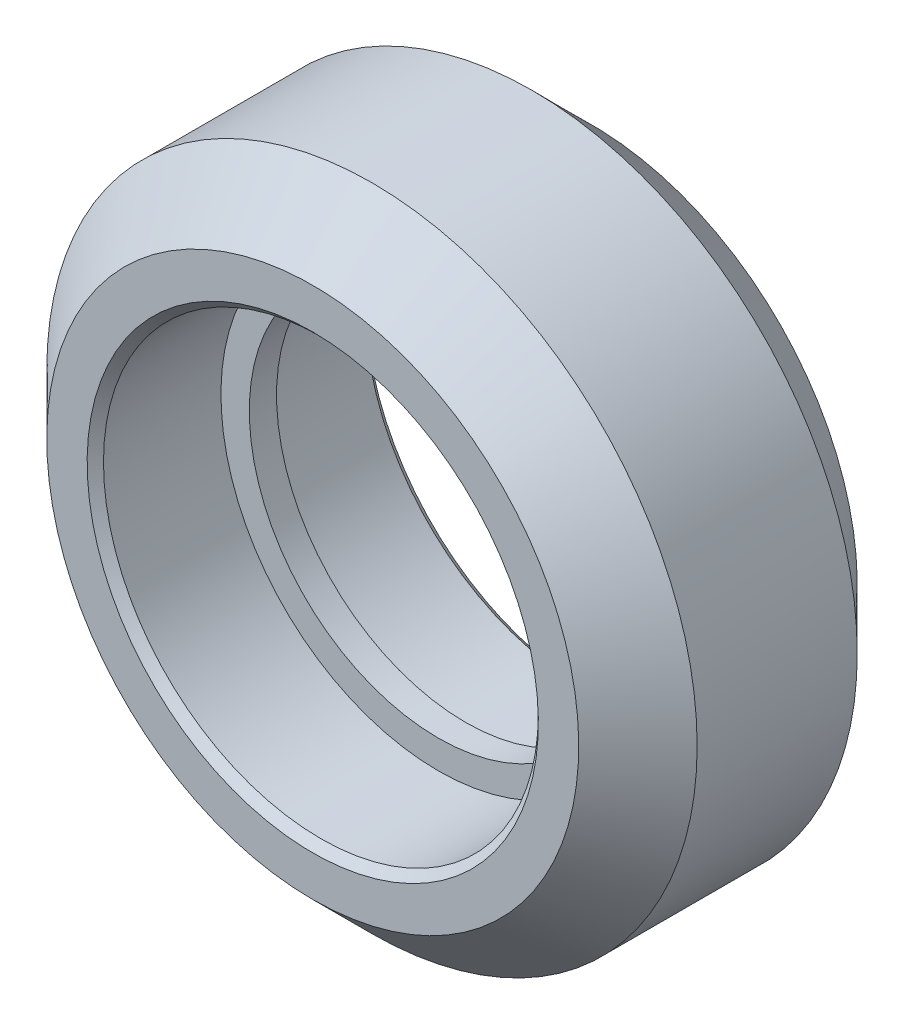
ISO-10303-21;
HEADER;
FILE_DESCRIPTION(('STEP AP214'),'2;1');
FILE_NAME('part.step','',(''),(''),'','','');
FILE_SCHEMA(('AUTOMOTIVE_DESIGN { 1 0 10303 214 1 1 1 1 }'));
ENDSEC;
DATA;
#1=APPLICATION_CONTEXT('core data for automotive mechanical design processes');
#2=APPLICATION_PROTOCOL_DEFINITION('international standard','automotive_design',2000,#1);
#3=PRODUCT_CONTEXT('',#1,'mechanical');
#4=PRODUCT('Part','Part','',(#3));
#5=PRODUCT_RELATED_PRODUCT_CATEGORY('part','',(#4));
#6=PRODUCT_DEFINITION_FORMATION('','',#4);
#7=PRODUCT_DEFINITION_CONTEXT('part definition',#1,'design');
#8=PRODUCT_DEFINITION('design','',#6,#7);
#9=PRODUCT_DEFINITION_SHAPE('','',#8);
#10=(LENGTH_UNIT() NAMED_UNIT(*) SI_UNIT(.MILLI.,.METRE.));
#11=(NAMED_UNIT(*) PLANE_ANGLE_UNIT() SI_UNIT($,.RADIAN.));
#12=(NAMED_UNIT(*) SI_UNIT($,.STERADIAN.) SOLID_ANGLE_UNIT());
#13=UNCERTAINTY_MEASURE_WITH_UNIT(LENGTH_MEASURE(1.E-05),#10,'distance_accuracy_value','');
#14=(GEOMETRIC_REPRESENTATION_CONTEXT(3) GLOBAL_UNCERTAINTY_ASSIGNED_CONTEXT((#13)) GLOBAL_UNIT_ASSIGNED_CONTEXT((#10,
#11,#12)) REPRESENTATION_CONTEXT('',''));
#15=CARTESIAN_POINT('',(0.,0.,0.));
#16=DIRECTION('',(0.,0.,1.));
#17=DIRECTION('',(1.,0.,0.));
#18=AXIS2_PLACEMENT_3D('',#15,#16,#17);
#19=CARTESIAN_POINT('',(0.,0.,5.115));
#20=DIRECTION('',(0.,0.,1.));
#21=DIRECTION('',(0.,-1.,0.));
#22=AXIS2_PLACEMENT_3D('',#19,#20,#21);
#23=CYLINDRICAL_SURFACE('',#22,7.987);
#24=CARTESIAN_POINT('',(0.,0.,4.815));
#25=DIRECTION('',(0.,0.,-1.));
#26=DIRECTION('',(0.,1.,0.));
#27=AXIS2_PLACEMENT_3D('',#24,#25,#26);
#28=CIRCLE('',#27,7.987);
#29=CARTESIAN_POINT('',(0.,7.987,4.815));
#30=VERTEX_POINT('',#29);
#31=EDGE_CURVE('E46',#30,#30,#28,.F.);
#32=ORIENTED_EDGE('',*,*,#31,.T.);
#33=EDGE_LOOP('',(#32));
#34=FACE_BOUND('',#33,.T.);
#35=CARTESIAN_POINT('',(0.,0.,0.499999999999998));
#36=DIRECTION('',(0.,0.,1.));
#37=DIRECTION('',(0.,-1.,0.));
#38=AXIS2_PLACEMENT_3D('',#35,#36,#37);
#39=CIRCLE('',#38,7.987);
#40=CARTESIAN_POINT('',(0.,-7.987,0.499999999999996));
#41=VERTEX_POINT('',#40);
#42=EDGE_CURVE('E72',#41,#41,#39,.T.);
#43=ORIENTED_EDGE('',*,*,#42,.F.);
#44=EDGE_LOOP('',(#43));
#45=FACE_BOUND('',#44,.T.);
#46=ADVANCED_FACE('F31',(#34,#45),#23,.F.);
#47=CARTESIAN_POINT('',(0.,9.77,5.115));
#48=DIRECTION('',(0.,0.,-1.));
#49=DIRECTION('',(0.,1.,0.));
#50=AXIS2_PLACEMENT_3D('',#47,#48,#49);
#51=PLANE('',#50);
#52=CARTESIAN_POINT('',(0.,0.,5.115));
#53=DIRECTION('',(0.,0.,-1.));
#54=DIRECTION('',(0.,1.,0.));
#55=AXIS2_PLACEMENT_3D('',#52,#53,#54);
#56=CIRCLE('',#55,8.28699999999999);
#57=CARTESIAN_POINT('',(0.,8.28699999999999,5.115));
#58=VERTEX_POINT('',#57);
#59=EDGE_CURVE('E42',#58,#58,#56,.T.);
#60=ORIENTED_EDGE('',*,*,#59,.T.);
#61=EDGE_LOOP('',(#60));
#62=FACE_BOUND('',#61,.T.);
#63=CARTESIAN_POINT('',(0.,0.,5.115));
#64=DIRECTION('',(0.,0.,1.));
#65=DIRECTION('',(0.,-1.,0.));
#66=AXIS2_PLACEMENT_3D('',#63,#64,#65);
#67=CIRCLE('',#66,9.77);
#68=CARTESIAN_POINT('',(0.,-9.77,5.115));
#69=VERTEX_POINT('',#68);
#70=EDGE_CURVE('E51',#69,#69,#67,.T.);
#71=ORIENTED_EDGE('',*,*,#70,.T.);
#72=EDGE_LOOP('',(#71));
#73=FACE_BOUND('',#72,.T.);
#74=ADVANCED_FACE('F79',(#62,#73),#51,.F.);
#75=CARTESIAN_POINT('',(0.,0.,2.94));
#76=DIRECTION('',(0.,0.,-1.));
#77=DIRECTION('',(0.,1.,0.));
#78=AXIS2_PLACEMENT_3D('',#75,#76,#77);
#79=CONICAL_SURFACE('',#78,11.945,0.78539816339745);
#80=ORIENTED_EDGE('',*,*,#70,.F.);
#81=EDGE_LOOP('',(#80));
#82=FACE_BOUND('',#81,.T.);
#83=CARTESIAN_POINT('',(0.,0.,2.94));
#84=DIRECTION('',(0.,0.,1.));
#85=DIRECTION('',(0.,-1.,0.));
#86=AXIS2_PLACEMENT_3D('',#83,#84,#85);
#87=CIRCLE('',#86,11.945);
#88=CARTESIAN_POINT('',(0.,-11.945,2.94));
#89=VERTEX_POINT('',#88);
#90=EDGE_CURVE('E54',#89,#89,#87,.T.);
#91=ORIENTED_EDGE('',*,*,#90,.T.);
#92=EDGE_LOOP('',(#91));
#93=FACE_BOUND('',#92,.T.);
#94=ADVANCED_FACE('F85',(#82,#93),#79,.T.);
#95=CARTESIAN_POINT('',(0.,0.,5.115));
#96=DIRECTION('',(0.,0.,1.));
#97=DIRECTION('',(0.,-1.,0.));
#98=AXIS2_PLACEMENT_3D('',#95,#96,#97);
#99=CYLINDRICAL_SURFACE('',#98,11.945);
#100=ORIENTED_EDGE('',*,*,#90,.F.);
#101=EDGE_LOOP('',(#100));
#102=FACE_BOUND('',#101,.T.);
#103=CARTESIAN_POINT('',(0.,0.,-2.94000000000001));
#104=DIRECTION('',(0.,0.,1.));
#105=DIRECTION('',(0.,-1.,0.));
#106=AXIS2_PLACEMENT_3D('',#103,#104,#105);
#107=CIRCLE('',#106,11.945);
#108=CARTESIAN_POINT('',(0.,-11.945,-2.94000000000001));
#109=VERTEX_POINT('',#108);
#110=EDGE_CURVE('E57',#109,#109,#107,.T.);
#111=ORIENTED_EDGE('',*,*,#110,.T.);
#112=EDGE_LOOP('',(#111));
#113=FACE_BOUND('',#112,.T.);
#114=ADVANCED_FACE('F108',(#102,#113),#99,.T.);
#115=CARTESIAN_POINT('',(0.,0.,-5.115));
#116=DIRECTION('',(0.,0.,1.));
#117=DIRECTION('',(0.,-1.,0.));
#118=AXIS2_PLACEMENT_3D('',#115,#116,#117);
#119=CONICAL_SURFACE('',#118,9.77,0.78539816339745);
#120=ORIENTED_EDGE('',*,*,#110,.F.);
#121=EDGE_LOOP('',(#120));
#122=FACE_BOUND('',#121,.T.);
#123=CARTESIAN_POINT('',(0.,0.,-5.115));
#124=DIRECTION('',(0.,0.,1.));
#125=DIRECTION('',(0.,-1.,0.));
#126=AXIS2_PLACEMENT_3D('',#123,#124,#125);
#127=CIRCLE('',#126,9.77);
#128=CARTESIAN_POINT('',(0.,-9.77,-5.115));
#129=VERTEX_POINT('',#128);
#130=EDGE_CURVE('E60',#129,#129,#127,.T.);
#131=ORIENTED_EDGE('',*,*,#130,.T.);
#132=EDGE_LOOP('',(#131));
#133=FACE_BOUND('',#132,.T.);
#134=ADVANCED_FACE('F113',(#122,#133),#119,.T.);
#135=CARTESIAN_POINT('',(0.,9.77,-5.115));
#136=DIRECTION('',(0.,0.,1.));
#137=DIRECTION('',(0.,-1.,0.));
#138=AXIS2_PLACEMENT_3D('',#135,#136,#137);
#139=PLANE('',#138);
#140=CARTESIAN_POINT('',(0.,0.,-5.115));
#141=DIRECTION('',(0.,0.,1.));
#142=DIRECTION('',(0.,-1.,0.));
#143=AXIS2_PLACEMENT_3D('',#140,#141,#142);
#144=CIRCLE('',#143,8.287);
#145=CARTESIAN_POINT('',(0.,-8.287,-5.115));
#146=VERTEX_POINT('',#145);
#147=EDGE_CURVE('E38',#146,#146,#144,.T.);
#148=ORIENTED_EDGE('',*,*,#147,.T.);
#149=EDGE_LOOP('',(#148));
#150=FACE_BOUND('',#149,.T.);
#151=ORIENTED_EDGE('',*,*,#130,.F.);
#152=EDGE_LOOP('',(#151));
#153=FACE_BOUND('',#152,.T.);
#154=ADVANCED_FACE('F119',(#150,#153),#139,.F.);
#155=CARTESIAN_POINT('',(0.,0.,5.115));
#156=DIRECTION('',(0.,0.,1.));
#157=DIRECTION('',(0.,-1.,0.));
#158=AXIS2_PLACEMENT_3D('',#155,#156,#157);
#159=CYLINDRICAL_SURFACE('',#158,7.987);
#160=CARTESIAN_POINT('',(0.,0.,-4.815));
#161=DIRECTION('',(0.,0.,1.));
#162=DIRECTION('',(0.,-1.,0.));
#163=AXIS2_PLACEMENT_3D('',#160,#161,#162);
#164=CIRCLE('',#163,7.987);
#165=CARTESIAN_POINT('',(0.,-7.987,-4.815));
#166=VERTEX_POINT('',#165);
#167=EDGE_CURVE('E10',#166,#166,#164,.F.);
#168=ORIENTED_EDGE('',*,*,#167,.T.);
#169=EDGE_LOOP('',(#168));
#170=FACE_BOUND('',#169,.T.);
#171=CARTESIAN_POINT('',(0.,0.,-0.500000000000001));
#172=DIRECTION('',(0.,0.,1.));
#173=DIRECTION('',(0.,-1.,0.));
#174=AXIS2_PLACEMENT_3D('',#171,#172,#173);
#175=CIRCLE('',#174,7.987);
#176=CARTESIAN_POINT('',(0.,-7.987,-0.500000000000003));
#177=VERTEX_POINT('',#176);
#178=EDGE_CURVE('E63',#177,#177,#175,.T.);
#179=ORIENTED_EDGE('',*,*,#178,.T.);
#180=EDGE_LOOP('',(#179));
#181=FACE_BOUND('',#180,.T.);
#182=ADVANCED_FACE('F124',(#170,#181),#159,.F.);
#183=CARTESIAN_POINT('',(0.,7.987,-0.5));
#184=DIRECTION('',(0.,0.,1.));
#185=DIRECTION('',(0.,-1.,0.));
#186=AXIS2_PLACEMENT_3D('',#183,#184,#185);
#187=PLANE('',#186);
#188=ORIENTED_EDGE('',*,*,#178,.F.);
#189=EDGE_LOOP('',(#188));
#190=FACE_BOUND('',#189,.T.);
#191=CARTESIAN_POINT('',(0.,0.,-0.500000000000002));
#192=DIRECTION('',(0.,0.,1.));
#193=DIRECTION('',(0.,-1.,0.));
#194=AXIS2_PLACEMENT_3D('',#191,#192,#193);
#195=CIRCLE('',#194,6.945);
#196=CARTESIAN_POINT('',(0.,-6.945,-0.500000000000003));
#197=VERTEX_POINT('',#196);
#198=EDGE_CURVE('E66',#197,#197,#195,.T.);
#199=ORIENTED_EDGE('',*,*,#198,.T.);
#200=EDGE_LOOP('',(#199));
#201=FACE_BOUND('',#200,.T.);
#202=ADVANCED_FACE('F129',(#190,#201),#187,.F.);
#203=CARTESIAN_POINT('',(0.,0.,5.115));
#204=DIRECTION('',(0.,0.,1.));
#205=DIRECTION('',(0.,-1.,0.));
#206=AXIS2_PLACEMENT_3D('',#203,#204,#205);
#207=CYLINDRICAL_SURFACE('',#206,6.945);
#208=ORIENTED_EDGE('',*,*,#198,.F.);
#209=EDGE_LOOP('',(#208));
#210=FACE_BOUND('',#209,.T.);
#211=CARTESIAN_POINT('',(0.,0.,0.499999999999999));
#212=DIRECTION('',(0.,0.,1.));
#213=DIRECTION('',(0.,-1.,0.));
#214=AXIS2_PLACEMENT_3D('',#211,#212,#213);
#215=CIRCLE('',#214,6.945);
#216=CARTESIAN_POINT('',(0.,-6.945,0.499999999999997));
#217=VERTEX_POINT('',#216);
#218=EDGE_CURVE('E69',#217,#217,#215,.T.);
#219=ORIENTED_EDGE('',*,*,#218,.T.);
#220=EDGE_LOOP('',(#219));
#221=FACE_BOUND('',#220,.T.);
#222=ADVANCED_FACE('F97',(#210,#221),#207,.F.);
#223=CARTESIAN_POINT('',(0.,7.987,0.5));
#224=DIRECTION('',(0.,0.,-1.));
#225=DIRECTION('',(0.,1.,0.));
#226=AXIS2_PLACEMENT_3D('',#223,#224,#225);
#227=PLANE('',#226);
#228=ORIENTED_EDGE('',*,*,#218,.F.);
#229=EDGE_LOOP('',(#228));
#230=FACE_BOUND('',#229,.T.);
#231=ORIENTED_EDGE('',*,*,#42,.T.);
#232=EDGE_LOOP('',(#231));
#233=FACE_BOUND('',#232,.T.);
#234=ADVANCED_FACE('F76',(#230,#233),#227,.F.);
#235=CARTESIAN_POINT('',(0.,0.,4.815));
#236=DIRECTION('',(0.,0.,1.));
#237=DIRECTION('',(0.,-1.,0.));
#238=AXIS2_PLACEMENT_3D('',#235,#236,#237);
#239=CONICAL_SURFACE('',#238,7.987,0.785398163397443);
#240=ORIENTED_EDGE('',*,*,#59,.F.);
#241=EDGE_LOOP('',(#240));
#242=FACE_BOUND('',#241,.T.);
#243=ORIENTED_EDGE('',*,*,#31,.F.);
#244=EDGE_LOOP('',(#243));
#245=FACE_BOUND('',#244,.T.);
#246=ADVANCED_FACE('F89',(#242,#245),#239,.F.);
#247=CARTESIAN_POINT('',(0.,0.,-5.115));
#248=DIRECTION('',(0.,0.,-1.));
#249=DIRECTION('',(0.,1.,0.));
#250=AXIS2_PLACEMENT_3D('',#247,#248,#249);
#251=CONICAL_SURFACE('',#250,8.287,0.785398163397443);
#252=ORIENTED_EDGE('',*,*,#167,.F.);
#253=EDGE_LOOP('',(#252));
#254=FACE_BOUND('',#253,.T.);
#255=ORIENTED_EDGE('',*,*,#147,.F.);
#256=EDGE_LOOP('',(#255));
#257=FACE_BOUND('',#256,.T.);
#258=ADVANCED_FACE('F33',(#254,#257),#251,.F.);
#259=CLOSED_SHELL('',(#46,#74,#94,#114,#134,#154,#182,#202,#222,#234,#246,#258));
#260=MANIFOLD_SOLID_BREP('B2',#259);
#261=ADVANCED_BREP_SHAPE_REPRESENTATION('',(#18,#260),#14);
#262=SHAPE_DEFINITION_REPRESENTATION(#9,#261);
ENDSEC;
END-ISO-10303-21;
